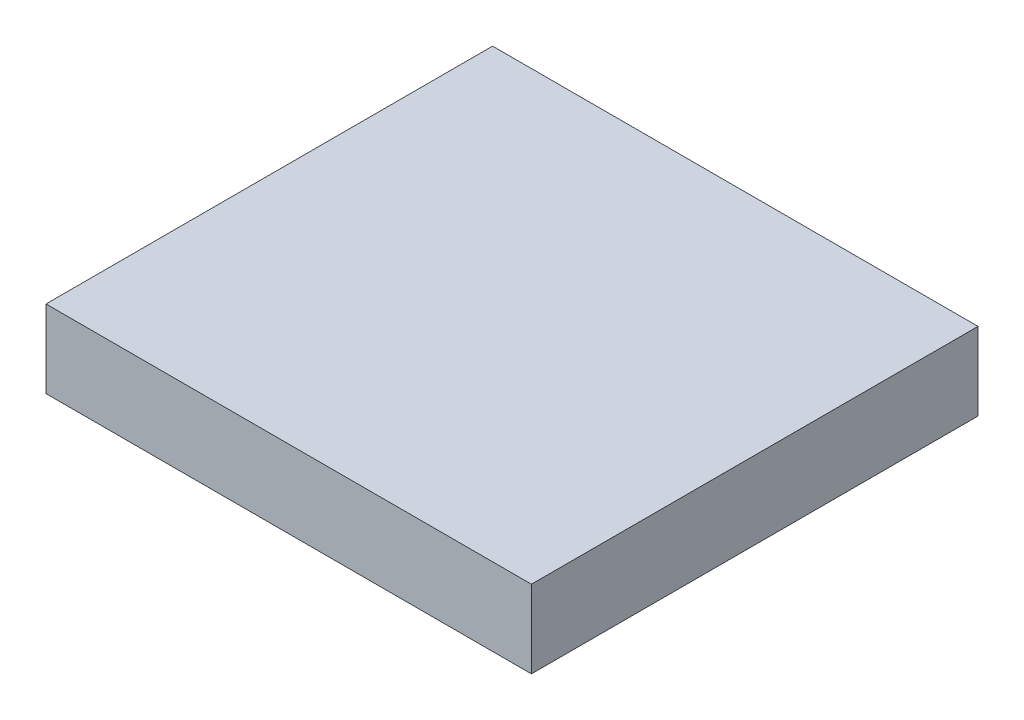
ISO-10303-21;
HEADER;
FILE_DESCRIPTION(('STEP AP214'),'2;1');
FILE_NAME('part.step','',(''),(''),'','','');
FILE_SCHEMA(('AUTOMOTIVE_DESIGN { 1 0 10303 214 1 1 1 1 }'));
ENDSEC;
DATA;
#1=APPLICATION_CONTEXT('core data for automotive mechanical design processes');
#2=APPLICATION_PROTOCOL_DEFINITION('international standard','automotive_design',2000,#1);
#3=PRODUCT_CONTEXT('',#1,'mechanical');
#4=PRODUCT('Part','Part','',(#3));
#5=PRODUCT_RELATED_PRODUCT_CATEGORY('part','',(#4));
#6=PRODUCT_DEFINITION_FORMATION('','',#4);
#7=PRODUCT_DEFINITION_CONTEXT('part definition',#1,'design');
#8=PRODUCT_DEFINITION('design','',#6,#7);
#9=PRODUCT_DEFINITION_SHAPE('','',#8);
#10=(LENGTH_UNIT() NAMED_UNIT(*) SI_UNIT(.MILLI.,.METRE.));
#11=(NAMED_UNIT(*) PLANE_ANGLE_UNIT() SI_UNIT($,.RADIAN.));
#12=(NAMED_UNIT(*) SI_UNIT($,.STERADIAN.) SOLID_ANGLE_UNIT());
#13=UNCERTAINTY_MEASURE_WITH_UNIT(LENGTH_MEASURE(1.E-05),#10,'distance_accuracy_value','');
#14=(GEOMETRIC_REPRESENTATION_CONTEXT(3) GLOBAL_UNCERTAINTY_ASSIGNED_CONTEXT((#13)) GLOBAL_UNIT_ASSIGNED_CONTEXT((#10,
#11,#12)) REPRESENTATION_CONTEXT('',''));
#15=CARTESIAN_POINT('',(0.,0.,0.));
#16=DIRECTION('',(0.,0.,1.));
#17=DIRECTION('',(1.,0.,0.));
#18=AXIS2_PLACEMENT_3D('',#15,#16,#17);
#19=CARTESIAN_POINT('',(250.,80.,-230.));
#20=DIRECTION('',(-1.,0.,0.));
#21=DIRECTION('',(0.,0.,1.));
#22=AXIS2_PLACEMENT_3D('',#19,#20,#21);
#23=PLANE('',#22);
#24=DIRECTION('',(0.,0.,-1.));
#25=VECTOR('',#24,1.);
#26=CARTESIAN_POINT('',(250.,0.,-230.));
#27=LINE('',#26,#25);
#28=CARTESIAN_POINT('',(250.,0.,230.));
#29=VERTEX_POINT('',#28);
#30=CARTESIAN_POINT('',(250.,0.,-230.));
#31=VERTEX_POINT('',#30);
#32=EDGE_CURVE('E102',#29,#31,#27,.T.);
#33=ORIENTED_EDGE('',*,*,#32,.T.);
#34=DIRECTION('',(0.,-1.,0.));
#35=VECTOR('',#34,1.);
#36=CARTESIAN_POINT('',(250.,80.,-230.));
#37=LINE('',#36,#35);
#38=CARTESIAN_POINT('',(250.,80.,-230.));
#39=VERTEX_POINT('',#38);
#40=EDGE_CURVE('E11',#39,#31,#37,.T.);
#41=ORIENTED_EDGE('',*,*,#40,.F.);
#42=DIRECTION('',(0.,0.,-1.));
#43=VECTOR('',#42,1.);
#44=CARTESIAN_POINT('',(250.,80.,-230.));
#45=LINE('',#44,#43);
#46=CARTESIAN_POINT('',(250.,80.,230.));
#47=VERTEX_POINT('',#46);
#48=EDGE_CURVE('E90',#47,#39,#45,.T.);
#49=ORIENTED_EDGE('',*,*,#48,.F.);
#50=DIRECTION('',(0.,-1.,0.));
#51=VECTOR('',#50,1.);
#52=CARTESIAN_POINT('',(250.,80.,230.));
#53=LINE('',#52,#51);
#54=EDGE_CURVE('E98',#47,#29,#53,.T.);
#55=ORIENTED_EDGE('',*,*,#54,.T.);
#56=EDGE_LOOP('',(#33,#41,#49,#55));
#57=FACE_BOUND('',#56,.T.);
#58=ADVANCED_FACE('F39',(#57),#23,.F.);
#59=CARTESIAN_POINT('',(-250.,80.,-230.));
#60=DIRECTION('',(0.,0.,1.));
#61=DIRECTION('',(1.,0.,0.));
#62=AXIS2_PLACEMENT_3D('',#59,#60,#61);
#63=PLANE('',#62);
#64=DIRECTION('',(-1.,0.,0.));
#65=VECTOR('',#64,1.);
#66=CARTESIAN_POINT('',(-250.,0.,-230.));
#67=LINE('',#66,#65);
#68=CARTESIAN_POINT('',(-250.,0.,-230.));
#69=VERTEX_POINT('',#68);
#70=EDGE_CURVE('E94',#31,#69,#67,.T.);
#71=ORIENTED_EDGE('',*,*,#70,.T.);
#72=DIRECTION('',(0.,-1.,0.));
#73=VECTOR('',#72,1.);
#74=CARTESIAN_POINT('',(-250.,80.,-230.));
#75=LINE('',#74,#73);
#76=CARTESIAN_POINT('',(-250.,80.,-230.));
#77=VERTEX_POINT('',#76);
#78=EDGE_CURVE('E47',#77,#69,#75,.T.);
#79=ORIENTED_EDGE('',*,*,#78,.F.);
#80=DIRECTION('',(-1.,0.,0.));
#81=VECTOR('',#80,1.);
#82=CARTESIAN_POINT('',(-250.,80.,-230.));
#83=LINE('',#82,#81);
#84=EDGE_CURVE('E85',#39,#77,#83,.T.);
#85=ORIENTED_EDGE('',*,*,#84,.F.);
#86=ORIENTED_EDGE('',*,*,#40,.T.);
#87=EDGE_LOOP('',(#71,#79,#85,#86));
#88=FACE_BOUND('',#87,.T.);
#89=ADVANCED_FACE('F93',(#88),#63,.F.);
#90=CARTESIAN_POINT('',(-250.,80.,-230.));
#91=DIRECTION('',(1.,0.,0.));
#92=DIRECTION('',(0.,0.,-1.));
#93=AXIS2_PLACEMENT_3D('',#90,#91,#92);
#94=PLANE('',#93);
#95=DIRECTION('',(0.,0.,1.));
#96=VECTOR('',#95,1.);
#97=CARTESIAN_POINT('',(-250.,0.,-230.));
#98=LINE('',#97,#96);
#99=CARTESIAN_POINT('',(-250.,0.,230.));
#100=VERTEX_POINT('',#99);
#101=EDGE_CURVE('E72',#69,#100,#98,.T.);
#102=ORIENTED_EDGE('',*,*,#101,.T.);
#103=DIRECTION('',(0.,-1.,0.));
#104=VECTOR('',#103,1.);
#105=CARTESIAN_POINT('',(-250.,80.,230.));
#106=LINE('',#105,#104);
#107=CARTESIAN_POINT('',(-250.,80.,230.));
#108=VERTEX_POINT('',#107);
#109=EDGE_CURVE('E95',#108,#100,#106,.T.);
#110=ORIENTED_EDGE('',*,*,#109,.F.);
#111=DIRECTION('',(0.,0.,1.));
#112=VECTOR('',#111,1.);
#113=CARTESIAN_POINT('',(-250.,80.,-230.));
#114=LINE('',#113,#112);
#115=EDGE_CURVE('E88',#77,#108,#114,.T.);
#116=ORIENTED_EDGE('',*,*,#115,.F.);
#117=ORIENTED_EDGE('',*,*,#78,.T.);
#118=EDGE_LOOP('',(#102,#110,#116,#117));
#119=FACE_BOUND('',#118,.T.);
#120=ADVANCED_FACE('F96',(#119),#94,.F.);
#121=CARTESIAN_POINT('',(-250.,80.,230.));
#122=DIRECTION('',(0.,0.,-1.));
#123=DIRECTION('',(-1.,0.,0.));
#124=AXIS2_PLACEMENT_3D('',#121,#122,#123);
#125=PLANE('',#124);
#126=DIRECTION('',(1.,0.,0.));
#127=VECTOR('',#126,1.);
#128=CARTESIAN_POINT('',(-250.,0.,230.));
#129=LINE('',#128,#127);
#130=EDGE_CURVE('E78',#100,#29,#129,.T.);
#131=ORIENTED_EDGE('',*,*,#130,.T.);
#132=ORIENTED_EDGE('',*,*,#54,.F.);
#133=DIRECTION('',(1.,0.,0.));
#134=VECTOR('',#133,1.);
#135=CARTESIAN_POINT('',(-250.,80.,230.));
#136=LINE('',#135,#134);
#137=EDGE_CURVE('E55',#108,#47,#136,.T.);
#138=ORIENTED_EDGE('',*,*,#137,.F.);
#139=ORIENTED_EDGE('',*,*,#109,.T.);
#140=EDGE_LOOP('',(#131,#132,#138,#139));
#141=FACE_BOUND('',#140,.T.);
#142=ADVANCED_FACE('F109',(#141),#125,.F.);
#143=CARTESIAN_POINT('',(0.,80.,0.));
#144=DIRECTION('',(0.,1.,0.));
#145=DIRECTION('',(0.,0.,1.));
#146=AXIS2_PLACEMENT_3D('',#143,#144,#145);
#147=PLANE('',#146);
#148=ORIENTED_EDGE('',*,*,#48,.T.);
#149=ORIENTED_EDGE('',*,*,#84,.T.);
#150=ORIENTED_EDGE('',*,*,#115,.T.);
#151=ORIENTED_EDGE('',*,*,#137,.T.);
#152=EDGE_LOOP('',(#148,#149,#150,#151));
#153=FACE_BOUND('',#152,.T.);
#154=ADVANCED_FACE('F86',(#153),#147,.T.);
#155=CARTESIAN_POINT('',(0.,0.,0.));
#156=DIRECTION('',(0.,1.,0.));
#157=DIRECTION('',(0.,0.,1.));
#158=AXIS2_PLACEMENT_3D('',#155,#156,#157);
#159=PLANE('',#158);
#160=ORIENTED_EDGE('',*,*,#32,.F.);
#161=ORIENTED_EDGE('',*,*,#130,.F.);
#162=ORIENTED_EDGE('',*,*,#101,.F.);
#163=ORIENTED_EDGE('',*,*,#70,.F.);
#164=EDGE_LOOP('',(#160,#161,#162,#163));
#165=FACE_BOUND('',#164,.T.);
#166=ADVANCED_FACE('F112',(#165),#159,.F.);
#167=CLOSED_SHELL('',(#58,#89,#120,#142,#154,#166));
#168=MANIFOLD_SOLID_BREP('B2',#167);
#169=ADVANCED_BREP_SHAPE_REPRESENTATION('',(#18,#168),#14);
#170=SHAPE_DEFINITION_REPRESENTATION(#9,#169);
ENDSEC;
END-ISO-10303-21;
